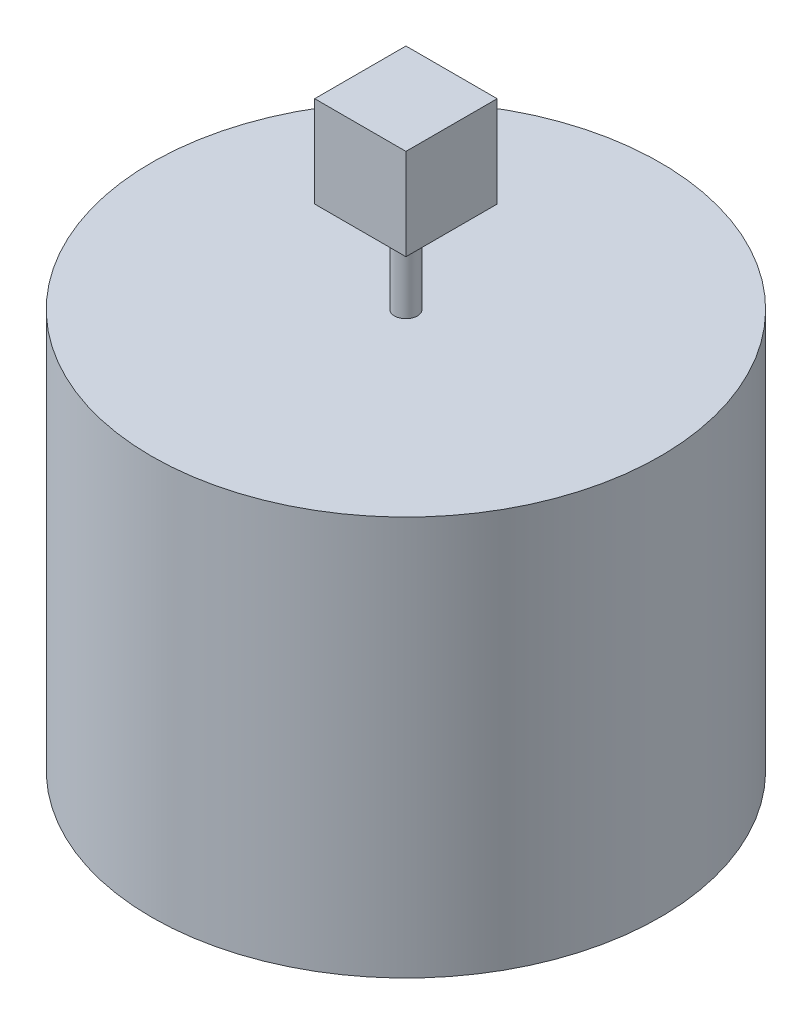
ISO-10303-21;
HEADER;
FILE_DESCRIPTION(('STEP AP214'),'2;1');
FILE_NAME('part.step','',(''),(''),'','','');
FILE_SCHEMA(('AUTOMOTIVE_DESIGN { 1 0 10303 214 1 1 1 1 }'));
ENDSEC;
DATA;
#1=APPLICATION_CONTEXT('core data for automotive mechanical design processes');
#2=APPLICATION_PROTOCOL_DEFINITION('international standard','automotive_design',2000,#1);
#3=PRODUCT_CONTEXT('',#1,'mechanical');
#4=PRODUCT('Part','Part','',(#3));
#5=PRODUCT_RELATED_PRODUCT_CATEGORY('part','',(#4));
#6=PRODUCT_DEFINITION_FORMATION('','',#4);
#7=PRODUCT_DEFINITION_CONTEXT('part definition',#1,'design');
#8=PRODUCT_DEFINITION('design','',#6,#7);
#9=PRODUCT_DEFINITION_SHAPE('','',#8);
#10=(LENGTH_UNIT() NAMED_UNIT(*) SI_UNIT(.MILLI.,.METRE.));
#11=(NAMED_UNIT(*) PLANE_ANGLE_UNIT() SI_UNIT($,.RADIAN.));
#12=(NAMED_UNIT(*) SI_UNIT($,.STERADIAN.) SOLID_ANGLE_UNIT());
#13=UNCERTAINTY_MEASURE_WITH_UNIT(LENGTH_MEASURE(1.E-05),#10,'distance_accuracy_value','');
#14=(GEOMETRIC_REPRESENTATION_CONTEXT(3) GLOBAL_UNCERTAINTY_ASSIGNED_CONTEXT((#13)) GLOBAL_UNIT_ASSIGNED_CONTEXT((#10,
#11,#12)) REPRESENTATION_CONTEXT('',''));
#15=CARTESIAN_POINT('',(0.,0.,0.));
#16=DIRECTION('',(0.,0.,1.));
#17=DIRECTION('',(1.,0.,0.));
#18=AXIS2_PLACEMENT_3D('',#15,#16,#17);
#19=CARTESIAN_POINT('',(0.,350.,0.));
#20=DIRECTION('',(0.,1.,0.));
#21=DIRECTION('',(0.,0.,1.));
#22=AXIS2_PLACEMENT_3D('',#19,#20,#21);
#23=PLANE('',#22);
#24=CARTESIAN_POINT('',(0.,350.,0.));
#25=DIRECTION('',(0.,1.,0.));
#26=DIRECTION('',(0.,0.,1.));
#27=AXIS2_PLACEMENT_3D('',#24,#25,#26);
#28=CIRCLE('',#27,223.);
#29=CARTESIAN_POINT('',(0.,350.,223.));
#30=VERTEX_POINT('',#29);
#31=EDGE_CURVE('E11',#30,#30,#28,.T.);
#32=ORIENTED_EDGE('',*,*,#31,.T.);
#33=EDGE_LOOP('',(#32));
#34=FACE_BOUND('',#33,.T.);
#35=CARTESIAN_POINT('',(0.,350.,0.));
#36=DIRECTION('',(0.,1.,0.));
#37=DIRECTION('',(0.,0.,1.));
#38=AXIS2_PLACEMENT_3D('',#35,#36,#37);
#39=CIRCLE('',#38,10.);
#40=CARTESIAN_POINT('',(0.,350.,10.));
#41=VERTEX_POINT('',#40);
#42=EDGE_CURVE('E108',#41,#41,#39,.T.);
#43=ORIENTED_EDGE('',*,*,#42,.F.);
#44=EDGE_LOOP('',(#43));
#45=FACE_BOUND('',#44,.T.);
#46=ADVANCED_FACE('F31',(#34,#45),#23,.T.);
#47=CARTESIAN_POINT('',(0.,350.,0.));
#48=DIRECTION('',(0.,-1.,0.));
#49=DIRECTION('',(0.,0.,-1.));
#50=AXIS2_PLACEMENT_3D('',#47,#48,#49);
#51=CYLINDRICAL_SURFACE('',#50,223.);
#52=ORIENTED_EDGE('',*,*,#31,.F.);
#53=EDGE_LOOP('',(#52));
#54=FACE_BOUND('',#53,.T.);
#55=CARTESIAN_POINT('',(0.,0.,0.));
#56=DIRECTION('',(0.,1.,0.));
#57=DIRECTION('',(0.,0.,1.));
#58=AXIS2_PLACEMENT_3D('',#55,#56,#57);
#59=CIRCLE('',#58,223.);
#60=CARTESIAN_POINT('',(0.,0.,223.));
#61=VERTEX_POINT('',#60);
#62=EDGE_CURVE('E35',#61,#61,#59,.T.);
#63=ORIENTED_EDGE('',*,*,#62,.T.);
#64=EDGE_LOOP('',(#63));
#65=FACE_BOUND('',#64,.T.);
#66=ADVANCED_FACE('F33',(#54,#65),#51,.T.);
#67=CARTESIAN_POINT('',(0.,0.,0.));
#68=DIRECTION('',(0.,1.,0.));
#69=DIRECTION('',(0.,0.,1.));
#70=AXIS2_PLACEMENT_3D('',#67,#68,#69);
#71=PLANE('',#70);
#72=ORIENTED_EDGE('',*,*,#62,.F.);
#73=EDGE_LOOP('',(#72));
#74=FACE_BOUND('',#73,.T.);
#75=ADVANCED_FACE('F123',(#74),#71,.F.);
#76=CARTESIAN_POINT('',(0.,430.,0.));
#77=DIRECTION('',(0.,-1.,0.));
#78=DIRECTION('',(0.,0.,-1.));
#79=AXIS2_PLACEMENT_3D('',#76,#77,#78);
#80=CYLINDRICAL_SURFACE('',#79,10.);
#81=CARTESIAN_POINT('',(0.,430.,0.));
#82=DIRECTION('',(0.,1.,0.));
#83=DIRECTION('',(0.,0.,1.));
#84=AXIS2_PLACEMENT_3D('',#81,#82,#83);
#85=CIRCLE('',#84,10.);
#86=CARTESIAN_POINT('',(0.,430.,10.));
#87=VERTEX_POINT('',#86);
#88=EDGE_CURVE('E109',#87,#87,#85,.T.);
#89=ORIENTED_EDGE('',*,*,#88,.F.);
#90=EDGE_LOOP('',(#89));
#91=FACE_BOUND('',#90,.T.);
#92=ORIENTED_EDGE('',*,*,#42,.T.);
#93=EDGE_LOOP('',(#92));
#94=FACE_BOUND('',#93,.T.);
#95=ADVANCED_FACE('F115',(#91,#94),#80,.T.);
#96=CARTESIAN_POINT('',(-40.,430.,-40.));
#97=DIRECTION('',(0.,-1.,0.));
#98=DIRECTION('',(0.,0.,-1.));
#99=AXIS2_PLACEMENT_3D('',#96,#97,#98);
#100=PLANE('',#99);
#101=DIRECTION('',(0.,0.,1.));
#102=VECTOR('',#101,1.);
#103=CARTESIAN_POINT('',(-40.,430.,40.));
#104=LINE('',#103,#102);
#105=CARTESIAN_POINT('',(-40.,430.,-40.));
#106=VERTEX_POINT('',#105);
#107=CARTESIAN_POINT('',(-40.,430.,40.));
#108=VERTEX_POINT('',#107);
#109=EDGE_CURVE('E99',#106,#108,#104,.T.);
#110=ORIENTED_EDGE('',*,*,#109,.F.);
#111=DIRECTION('',(-1.,0.,0.));
#112=VECTOR('',#111,1.);
#113=CARTESIAN_POINT('',(-40.,430.,-40.));
#114=LINE('',#113,#112);
#115=CARTESIAN_POINT('',(40.,430.,-40.));
#116=VERTEX_POINT('',#115);
#117=EDGE_CURVE('E71',#116,#106,#114,.T.);
#118=ORIENTED_EDGE('',*,*,#117,.F.);
#119=DIRECTION('',(0.,0.,-1.));
#120=VECTOR('',#119,1.);
#121=CARTESIAN_POINT('',(40.,430.,40.));
#122=LINE('',#121,#120);
#123=CARTESIAN_POINT('',(40.,430.,40.));
#124=VERTEX_POINT('',#123);
#125=EDGE_CURVE('E65',#124,#116,#122,.T.);
#126=ORIENTED_EDGE('',*,*,#125,.F.);
#127=DIRECTION('',(1.,0.,0.));
#128=VECTOR('',#127,1.);
#129=CARTESIAN_POINT('',(-40.,430.,40.));
#130=LINE('',#129,#128);
#131=EDGE_CURVE('E89',#108,#124,#130,.T.);
#132=ORIENTED_EDGE('',*,*,#131,.F.);
#133=EDGE_LOOP('',(#110,#118,#126,#132));
#134=FACE_BOUND('',#133,.T.);
#135=ORIENTED_EDGE('',*,*,#88,.T.);
#136=EDGE_LOOP('',(#135));
#137=FACE_BOUND('',#136,.T.);
#138=ADVANCED_FACE('F132',(#134,#137),#100,.T.);
#139=CARTESIAN_POINT('',(-40.,510.,40.));
#140=DIRECTION('',(1.,0.,0.));
#141=DIRECTION('',(0.,0.,-1.));
#142=AXIS2_PLACEMENT_3D('',#139,#140,#141);
#143=PLANE('',#142);
#144=ORIENTED_EDGE('',*,*,#109,.T.);
#145=DIRECTION('',(0.,-1.,0.));
#146=VECTOR('',#145,1.);
#147=CARTESIAN_POINT('',(-40.,510.,40.));
#148=LINE('',#147,#146);
#149=CARTESIAN_POINT('',(-40.,510.,40.));
#150=VERTEX_POINT('',#149);
#151=EDGE_CURVE('E90',#150,#108,#148,.T.);
#152=ORIENTED_EDGE('',*,*,#151,.F.);
#153=DIRECTION('',(0.,0.,1.));
#154=VECTOR('',#153,1.);
#155=CARTESIAN_POINT('',(-40.,510.,40.));
#156=LINE('',#155,#154);
#157=CARTESIAN_POINT('',(-40.,510.,-40.));
#158=VERTEX_POINT('',#157);
#159=EDGE_CURVE('E84',#158,#150,#156,.T.);
#160=ORIENTED_EDGE('',*,*,#159,.F.);
#161=DIRECTION('',(0.,-1.,0.));
#162=VECTOR('',#161,1.);
#163=CARTESIAN_POINT('',(-40.,510.,-40.));
#164=LINE('',#163,#162);
#165=EDGE_CURVE('E95',#158,#106,#164,.T.);
#166=ORIENTED_EDGE('',*,*,#165,.T.);
#167=EDGE_LOOP('',(#144,#152,#160,#166));
#168=FACE_BOUND('',#167,.T.);
#169=ADVANCED_FACE('F140',(#168),#143,.F.);
#170=CARTESIAN_POINT('',(-40.,510.,40.));
#171=DIRECTION('',(0.,0.,-1.));
#172=DIRECTION('',(-1.,0.,0.));
#173=AXIS2_PLACEMENT_3D('',#170,#171,#172);
#174=PLANE('',#173);
#175=ORIENTED_EDGE('',*,*,#131,.T.);
#176=DIRECTION('',(0.,-1.,0.));
#177=VECTOR('',#176,1.);
#178=CARTESIAN_POINT('',(40.,510.,40.));
#179=LINE('',#178,#177);
#180=CARTESIAN_POINT('',(40.,510.,40.));
#181=VERTEX_POINT('',#180);
#182=EDGE_CURVE('E87',#181,#124,#179,.T.);
#183=ORIENTED_EDGE('',*,*,#182,.F.);
#184=DIRECTION('',(1.,0.,0.));
#185=VECTOR('',#184,1.);
#186=CARTESIAN_POINT('',(-40.,510.,40.));
#187=LINE('',#186,#185);
#188=EDGE_CURVE('E79',#150,#181,#187,.T.);
#189=ORIENTED_EDGE('',*,*,#188,.F.);
#190=ORIENTED_EDGE('',*,*,#151,.T.);
#191=EDGE_LOOP('',(#175,#183,#189,#190));
#192=FACE_BOUND('',#191,.T.);
#193=ADVANCED_FACE('F88',(#192),#174,.F.);
#194=CARTESIAN_POINT('',(40.,510.,40.));
#195=DIRECTION('',(-1.,0.,0.));
#196=DIRECTION('',(0.,0.,1.));
#197=AXIS2_PLACEMENT_3D('',#194,#195,#196);
#198=PLANE('',#197);
#199=ORIENTED_EDGE('',*,*,#125,.T.);
#200=DIRECTION('',(0.,-1.,0.));
#201=VECTOR('',#200,1.);
#202=CARTESIAN_POINT('',(40.,510.,-40.));
#203=LINE('',#202,#201);
#204=CARTESIAN_POINT('',(40.,510.,-40.));
#205=VERTEX_POINT('',#204);
#206=EDGE_CURVE('E91',#205,#116,#203,.T.);
#207=ORIENTED_EDGE('',*,*,#206,.F.);
#208=DIRECTION('',(0.,0.,-1.));
#209=VECTOR('',#208,1.);
#210=CARTESIAN_POINT('',(40.,510.,40.));
#211=LINE('',#210,#209);
#212=EDGE_CURVE('E82',#181,#205,#211,.T.);
#213=ORIENTED_EDGE('',*,*,#212,.F.);
#214=ORIENTED_EDGE('',*,*,#182,.T.);
#215=EDGE_LOOP('',(#199,#207,#213,#214));
#216=FACE_BOUND('',#215,.T.);
#217=ADVANCED_FACE('F93',(#216),#198,.F.);
#218=CARTESIAN_POINT('',(-40.,510.,-40.));
#219=DIRECTION('',(0.,0.,1.));
#220=DIRECTION('',(1.,0.,0.));
#221=AXIS2_PLACEMENT_3D('',#218,#219,#220);
#222=PLANE('',#221);
#223=ORIENTED_EDGE('',*,*,#117,.T.);
#224=ORIENTED_EDGE('',*,*,#165,.F.);
#225=DIRECTION('',(-1.,0.,0.));
#226=VECTOR('',#225,1.);
#227=CARTESIAN_POINT('',(-40.,510.,-40.));
#228=LINE('',#227,#226);
#229=EDGE_CURVE('E48',#205,#158,#228,.T.);
#230=ORIENTED_EDGE('',*,*,#229,.F.);
#231=ORIENTED_EDGE('',*,*,#206,.T.);
#232=EDGE_LOOP('',(#223,#224,#230,#231));
#233=FACE_BOUND('',#232,.T.);
#234=ADVANCED_FACE('F152',(#233),#222,.F.);
#235=CARTESIAN_POINT('',(-40.,510.,-40.));
#236=DIRECTION('',(0.,-1.,0.));
#237=DIRECTION('',(0.,0.,-1.));
#238=AXIS2_PLACEMENT_3D('',#235,#236,#237);
#239=PLANE('',#238);
#240=ORIENTED_EDGE('',*,*,#159,.T.);
#241=ORIENTED_EDGE('',*,*,#188,.T.);
#242=ORIENTED_EDGE('',*,*,#212,.T.);
#243=ORIENTED_EDGE('',*,*,#229,.T.);
#244=EDGE_LOOP('',(#240,#241,#242,#243));
#245=FACE_BOUND('',#244,.T.);
#246=ADVANCED_FACE('F80',(#245),#239,.F.);
#247=CLOSED_SHELL('',(#46,#66,#75,#95,#138,#169,#193,#217,#234,#246));
#248=MANIFOLD_SOLID_BREP('B2',#247);
#249=ADVANCED_BREP_SHAPE_REPRESENTATION('',(#18,#248),#14);
#250=SHAPE_DEFINITION_REPRESENTATION(#9,#249);
ENDSEC;
END-ISO-10303-21;
